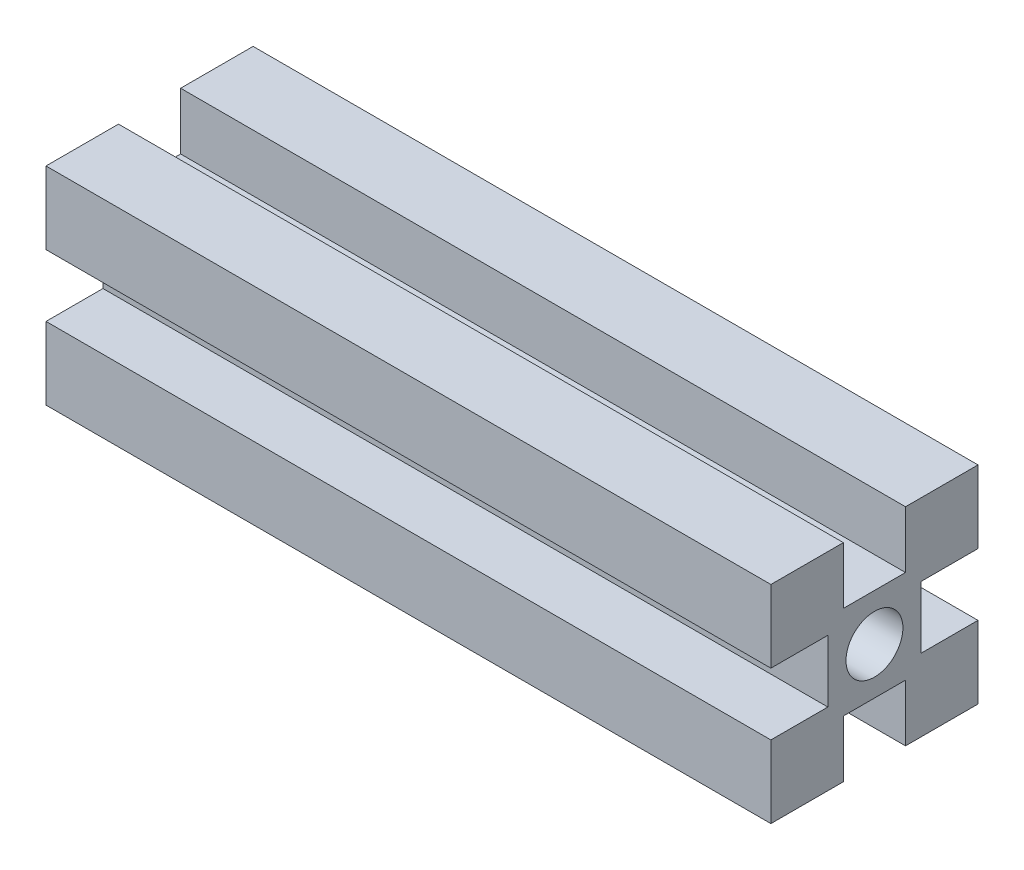
ISO-10303-21;
HEADER;
FILE_DESCRIPTION(('STEP AP214'),'2;1');
FILE_NAME('part.step','',(''),(''),'','','');
FILE_SCHEMA(('AUTOMOTIVE_DESIGN { 1 0 10303 214 1 1 1 1 }'));
ENDSEC;
DATA;
#1=APPLICATION_CONTEXT('core data for automotive mechanical design processes');
#2=APPLICATION_PROTOCOL_DEFINITION('international standard','automotive_design',2000,#1);
#3=PRODUCT_CONTEXT('',#1,'mechanical');
#4=PRODUCT('Part','Part','',(#3));
#5=PRODUCT_RELATED_PRODUCT_CATEGORY('part','',(#4));
#6=PRODUCT_DEFINITION_FORMATION('','',#4);
#7=PRODUCT_DEFINITION_CONTEXT('part definition',#1,'design');
#8=PRODUCT_DEFINITION('design','',#6,#7);
#9=PRODUCT_DEFINITION_SHAPE('','',#8);
#10=(LENGTH_UNIT() NAMED_UNIT(*) SI_UNIT(.MILLI.,.METRE.));
#11=(NAMED_UNIT(*) PLANE_ANGLE_UNIT() SI_UNIT($,.RADIAN.));
#12=(NAMED_UNIT(*) SI_UNIT($,.STERADIAN.) SOLID_ANGLE_UNIT());
#13=UNCERTAINTY_MEASURE_WITH_UNIT(LENGTH_MEASURE(1.E-05),#10,'distance_accuracy_value','');
#14=(GEOMETRIC_REPRESENTATION_CONTEXT(3) GLOBAL_UNCERTAINTY_ASSIGNED_CONTEXT((#13)) GLOBAL_UNIT_ASSIGNED_CONTEXT((#10,
#11,#12)) REPRESENTATION_CONTEXT('',''));
#15=CARTESIAN_POINT('',(0.,0.,0.));
#16=DIRECTION('',(0.,0.,1.));
#17=DIRECTION('',(1.,0.,0.));
#18=AXIS2_PLACEMENT_3D('',#15,#16,#17);
#19=CARTESIAN_POINT('',(70.,10.,-10.));
#20=DIRECTION('',(0.,0.,-1.));
#21=DIRECTION('',(-1.,0.,0.));
#22=AXIS2_PLACEMENT_3D('',#19,#20,#21);
#23=PLANE('',#22);
#24=DIRECTION('',(0.,-1.,0.));
#25=VECTOR('',#24,1.);
#26=CARTESIAN_POINT('',(0.,10.,-10.));
#27=LINE('',#26,#25);
#28=CARTESIAN_POINT('',(0.,10.,-10.));
#29=VERTEX_POINT('',#28);
#30=CARTESIAN_POINT('',(0.,3.,-10.));
#31=VERTEX_POINT('',#30);
#32=EDGE_CURVE('E214',#29,#31,#27,.T.);
#33=ORIENTED_EDGE('',*,*,#32,.F.);
#34=DIRECTION('',(-1.,0.,0.));
#35=VECTOR('',#34,1.);
#36=CARTESIAN_POINT('',(70.,10.,-10.));
#37=LINE('',#36,#35);
#38=CARTESIAN_POINT('',(70.,10.,-10.));
#39=VERTEX_POINT('',#38);
#40=EDGE_CURVE('E11',#39,#29,#37,.T.);
#41=ORIENTED_EDGE('',*,*,#40,.F.);
#42=DIRECTION('',(0.,-1.,0.));
#43=VECTOR('',#42,1.);
#44=CARTESIAN_POINT('',(70.,10.,-10.));
#45=LINE('',#44,#43);
#46=CARTESIAN_POINT('',(70.,3.,-10.));
#47=VERTEX_POINT('',#46);
#48=EDGE_CURVE('E291',#39,#47,#45,.T.);
#49=ORIENTED_EDGE('',*,*,#48,.T.);
#50=DIRECTION('',(-1.,0.,0.));
#51=VECTOR('',#50,1.);
#52=CARTESIAN_POINT('',(70.,3.,-10.));
#53=LINE('',#52,#51);
#54=EDGE_CURVE('E42',#47,#31,#53,.T.);
#55=ORIENTED_EDGE('',*,*,#54,.T.);
#56=EDGE_LOOP('',(#33,#41,#49,#55));
#57=FACE_BOUND('',#56,.T.);
#58=ADVANCED_FACE('F39',(#57),#23,.T.);
#59=CARTESIAN_POINT('',(70.,10.,-3.));
#60=DIRECTION('',(0.,1.,0.));
#61=DIRECTION('',(0.,0.,1.));
#62=AXIS2_PLACEMENT_3D('',#59,#60,#61);
#63=PLANE('',#62);
#64=DIRECTION('',(0.,0.,-1.));
#65=VECTOR('',#64,1.);
#66=CARTESIAN_POINT('',(0.,10.,-3.));
#67=LINE('',#66,#65);
#68=CARTESIAN_POINT('',(0.,10.,-3.));
#69=VERTEX_POINT('',#68);
#70=EDGE_CURVE('E288',#69,#29,#67,.T.);
#71=ORIENTED_EDGE('',*,*,#70,.F.);
#72=DIRECTION('',(-1.,0.,0.));
#73=VECTOR('',#72,1.);
#74=CARTESIAN_POINT('',(70.,10.,-3.));
#75=LINE('',#74,#73);
#76=CARTESIAN_POINT('',(70.,10.,-3.));
#77=VERTEX_POINT('',#76);
#78=EDGE_CURVE('E49',#77,#69,#75,.T.);
#79=ORIENTED_EDGE('',*,*,#78,.F.);
#80=DIRECTION('',(0.,0.,-1.));
#81=VECTOR('',#80,1.);
#82=CARTESIAN_POINT('',(70.,10.,-3.));
#83=LINE('',#82,#81);
#84=EDGE_CURVE('E200',#77,#39,#83,.T.);
#85=ORIENTED_EDGE('',*,*,#84,.T.);
#86=ORIENTED_EDGE('',*,*,#40,.T.);
#87=EDGE_LOOP('',(#71,#79,#85,#86));
#88=FACE_BOUND('',#87,.T.);
#89=ADVANCED_FACE('F345',(#88),#63,.T.);
#90=CARTESIAN_POINT('',(70.,4.5,-3.));
#91=DIRECTION('',(0.,0.,1.));
#92=DIRECTION('',(1.,0.,0.));
#93=AXIS2_PLACEMENT_3D('',#90,#91,#92);
#94=PLANE('',#93);
#95=DIRECTION('',(0.,1.,0.));
#96=VECTOR('',#95,1.);
#97=CARTESIAN_POINT('',(0.,4.5,-3.));
#98=LINE('',#97,#96);
#99=CARTESIAN_POINT('',(0.,4.5,-3.));
#100=VERTEX_POINT('',#99);
#101=EDGE_CURVE('E186',#100,#69,#98,.T.);
#102=ORIENTED_EDGE('',*,*,#101,.F.);
#103=DIRECTION('',(-1.,0.,0.));
#104=VECTOR('',#103,1.);
#105=CARTESIAN_POINT('',(70.,4.5,-3.));
#106=LINE('',#105,#104);
#107=CARTESIAN_POINT('',(70.,4.5,-3.));
#108=VERTEX_POINT('',#107);
#109=EDGE_CURVE('E181',#108,#100,#106,.T.);
#110=ORIENTED_EDGE('',*,*,#109,.F.);
#111=DIRECTION('',(0.,1.,0.));
#112=VECTOR('',#111,1.);
#113=CARTESIAN_POINT('',(70.,4.5,-3.));
#114=LINE('',#113,#112);
#115=EDGE_CURVE('E184',#108,#77,#114,.T.);
#116=ORIENTED_EDGE('',*,*,#115,.T.);
#117=ORIENTED_EDGE('',*,*,#78,.T.);
#118=EDGE_LOOP('',(#102,#110,#116,#117));
#119=FACE_BOUND('',#118,.T.);
#120=ADVANCED_FACE('F183',(#119),#94,.T.);
#121=CARTESIAN_POINT('',(70.,4.5,3.));
#122=DIRECTION('',(0.,1.,0.));
#123=DIRECTION('',(0.,0.,1.));
#124=AXIS2_PLACEMENT_3D('',#121,#122,#123);
#125=PLANE('',#124);
#126=DIRECTION('',(0.,0.,-1.));
#127=VECTOR('',#126,1.);
#128=CARTESIAN_POINT('',(0.,4.5,3.));
#129=LINE('',#128,#127);
#130=CARTESIAN_POINT('',(0.,4.5,3.));
#131=VERTEX_POINT('',#130);
#132=EDGE_CURVE('E283',#131,#100,#129,.T.);
#133=ORIENTED_EDGE('',*,*,#132,.F.);
#134=DIRECTION('',(-1.,0.,0.));
#135=VECTOR('',#134,1.);
#136=CARTESIAN_POINT('',(70.,4.5,3.));
#137=LINE('',#136,#135);
#138=CARTESIAN_POINT('',(70.,4.5,3.));
#139=VERTEX_POINT('',#138);
#140=EDGE_CURVE('E192',#139,#131,#137,.T.);
#141=ORIENTED_EDGE('',*,*,#140,.F.);
#142=DIRECTION('',(0.,0.,-1.));
#143=VECTOR('',#142,1.);
#144=CARTESIAN_POINT('',(70.,4.5,3.));
#145=LINE('',#144,#143);
#146=EDGE_CURVE('E198',#139,#108,#145,.T.);
#147=ORIENTED_EDGE('',*,*,#146,.T.);
#148=ORIENTED_EDGE('',*,*,#109,.T.);
#149=EDGE_LOOP('',(#133,#141,#147,#148));
#150=FACE_BOUND('',#149,.T.);
#151=ADVANCED_FACE('F203',(#150),#125,.T.);
#152=CARTESIAN_POINT('',(70.,10.,3.));
#153=DIRECTION('',(0.,0.,-1.));
#154=DIRECTION('',(-1.,0.,0.));
#155=AXIS2_PLACEMENT_3D('',#152,#153,#154);
#156=PLANE('',#155);
#157=DIRECTION('',(0.,-1.,0.));
#158=VECTOR('',#157,1.);
#159=CARTESIAN_POINT('',(0.,10.,3.));
#160=LINE('',#159,#158);
#161=CARTESIAN_POINT('',(0.,10.,3.));
#162=VERTEX_POINT('',#161);
#163=EDGE_CURVE('E279',#162,#131,#160,.T.);
#164=ORIENTED_EDGE('',*,*,#163,.F.);
#165=DIRECTION('',(-1.,0.,0.));
#166=VECTOR('',#165,1.);
#167=CARTESIAN_POINT('',(70.,10.,3.));
#168=LINE('',#167,#166);
#169=CARTESIAN_POINT('',(70.,10.,3.));
#170=VERTEX_POINT('',#169);
#171=EDGE_CURVE('E297',#170,#162,#168,.T.);
#172=ORIENTED_EDGE('',*,*,#171,.F.);
#173=DIRECTION('',(0.,-1.,0.));
#174=VECTOR('',#173,1.);
#175=CARTESIAN_POINT('',(70.,10.,3.));
#176=LINE('',#175,#174);
#177=EDGE_CURVE('E205',#170,#139,#176,.T.);
#178=ORIENTED_EDGE('',*,*,#177,.T.);
#179=ORIENTED_EDGE('',*,*,#140,.T.);
#180=EDGE_LOOP('',(#164,#172,#178,#179));
#181=FACE_BOUND('',#180,.T.);
#182=ADVANCED_FACE('F358',(#181),#156,.T.);
#183=CARTESIAN_POINT('',(70.,10.,10.));
#184=DIRECTION('',(0.,1.,0.));
#185=DIRECTION('',(0.,0.,1.));
#186=AXIS2_PLACEMENT_3D('',#183,#184,#185);
#187=PLANE('',#186);
#188=DIRECTION('',(0.,0.,-1.));
#189=VECTOR('',#188,1.);
#190=CARTESIAN_POINT('',(0.,10.,10.));
#191=LINE('',#190,#189);
#192=CARTESIAN_POINT('',(0.,10.,10.));
#193=VERTEX_POINT('',#192);
#194=EDGE_CURVE('E275',#193,#162,#191,.T.);
#195=ORIENTED_EDGE('',*,*,#194,.F.);
#196=DIRECTION('',(-1.,0.,0.));
#197=VECTOR('',#196,1.);
#198=CARTESIAN_POINT('',(70.,10.,10.));
#199=LINE('',#198,#197);
#200=CARTESIAN_POINT('',(70.,10.,10.));
#201=VERTEX_POINT('',#200);
#202=EDGE_CURVE('E300',#201,#193,#199,.T.);
#203=ORIENTED_EDGE('',*,*,#202,.F.);
#204=DIRECTION('',(0.,0.,-1.));
#205=VECTOR('',#204,1.);
#206=CARTESIAN_POINT('',(70.,10.,10.));
#207=LINE('',#206,#205);
#208=EDGE_CURVE('E208',#201,#170,#207,.T.);
#209=ORIENTED_EDGE('',*,*,#208,.T.);
#210=ORIENTED_EDGE('',*,*,#171,.T.);
#211=EDGE_LOOP('',(#195,#203,#209,#210));
#212=FACE_BOUND('',#211,.T.);
#213=ADVANCED_FACE('F361',(#212),#187,.T.);
#214=CARTESIAN_POINT('',(70.,3.,10.));
#215=DIRECTION('',(0.,0.,1.));
#216=DIRECTION('',(1.,0.,0.));
#217=AXIS2_PLACEMENT_3D('',#214,#215,#216);
#218=PLANE('',#217);
#219=DIRECTION('',(0.,1.,0.));
#220=VECTOR('',#219,1.);
#221=CARTESIAN_POINT('',(0.,3.,10.));
#222=LINE('',#221,#220);
#223=CARTESIAN_POINT('',(0.,3.,10.));
#224=VERTEX_POINT('',#223);
#225=EDGE_CURVE('E271',#224,#193,#222,.T.);
#226=ORIENTED_EDGE('',*,*,#225,.F.);
#227=DIRECTION('',(-1.,0.,0.));
#228=VECTOR('',#227,1.);
#229=CARTESIAN_POINT('',(70.,3.,10.));
#230=LINE('',#229,#228);
#231=CARTESIAN_POINT('',(70.,3.,10.));
#232=VERTEX_POINT('',#231);
#233=EDGE_CURVE('E303',#232,#224,#230,.T.);
#234=ORIENTED_EDGE('',*,*,#233,.F.);
#235=DIRECTION('',(0.,1.,0.));
#236=VECTOR('',#235,1.);
#237=CARTESIAN_POINT('',(70.,3.,10.));
#238=LINE('',#237,#236);
#239=EDGE_CURVE('E496',#232,#201,#238,.T.);
#240=ORIENTED_EDGE('',*,*,#239,.T.);
#241=ORIENTED_EDGE('',*,*,#202,.T.);
#242=EDGE_LOOP('',(#226,#234,#240,#241));
#243=FACE_BOUND('',#242,.T.);
#244=ADVANCED_FACE('F365',(#243),#218,.T.);
#245=CARTESIAN_POINT('',(70.,3.,4.5));
#246=DIRECTION('',(0.,-1.,0.));
#247=DIRECTION('',(0.,0.,-1.));
#248=AXIS2_PLACEMENT_3D('',#245,#246,#247);
#249=PLANE('',#248);
#250=DIRECTION('',(0.,0.,1.));
#251=VECTOR('',#250,1.);
#252=CARTESIAN_POINT('',(0.,3.,4.5));
#253=LINE('',#252,#251);
#254=CARTESIAN_POINT('',(0.,3.,4.5));
#255=VERTEX_POINT('',#254);
#256=EDGE_CURVE('E267',#255,#224,#253,.T.);
#257=ORIENTED_EDGE('',*,*,#256,.F.);
#258=DIRECTION('',(-1.,0.,0.));
#259=VECTOR('',#258,1.);
#260=CARTESIAN_POINT('',(70.,3.,4.5));
#261=LINE('',#260,#259);
#262=CARTESIAN_POINT('',(70.,3.,4.5));
#263=VERTEX_POINT('',#262);
#264=EDGE_CURVE('E306',#263,#255,#261,.T.);
#265=ORIENTED_EDGE('',*,*,#264,.F.);
#266=DIRECTION('',(0.,0.,1.));
#267=VECTOR('',#266,1.);
#268=CARTESIAN_POINT('',(70.,3.,4.5));
#269=LINE('',#268,#267);
#270=EDGE_CURVE('E492',#263,#232,#269,.T.);
#271=ORIENTED_EDGE('',*,*,#270,.T.);
#272=ORIENTED_EDGE('',*,*,#233,.T.);
#273=EDGE_LOOP('',(#257,#265,#271,#272));
#274=FACE_BOUND('',#273,.T.);
#275=ADVANCED_FACE('F369',(#274),#249,.T.);
#276=CARTESIAN_POINT('',(70.,-3.,4.5));
#277=DIRECTION('',(0.,0.,1.));
#278=DIRECTION('',(1.,0.,0.));
#279=AXIS2_PLACEMENT_3D('',#276,#277,#278);
#280=PLANE('',#279);
#281=DIRECTION('',(0.,1.,0.));
#282=VECTOR('',#281,1.);
#283=CARTESIAN_POINT('',(0.,-3.,4.5));
#284=LINE('',#283,#282);
#285=CARTESIAN_POINT('',(0.,-3.,4.5));
#286=VERTEX_POINT('',#285);
#287=EDGE_CURVE('E263',#286,#255,#284,.T.);
#288=ORIENTED_EDGE('',*,*,#287,.F.);
#289=DIRECTION('',(-1.,0.,0.));
#290=VECTOR('',#289,1.);
#291=CARTESIAN_POINT('',(70.,-3.,4.5));
#292=LINE('',#291,#290);
#293=CARTESIAN_POINT('',(70.,-3.,4.5));
#294=VERTEX_POINT('',#293);
#295=EDGE_CURVE('E309',#294,#286,#292,.T.);
#296=ORIENTED_EDGE('',*,*,#295,.F.);
#297=DIRECTION('',(0.,1.,0.));
#298=VECTOR('',#297,1.);
#299=CARTESIAN_POINT('',(70.,-3.,4.5));
#300=LINE('',#299,#298);
#301=EDGE_CURVE('E488',#294,#263,#300,.T.);
#302=ORIENTED_EDGE('',*,*,#301,.T.);
#303=ORIENTED_EDGE('',*,*,#264,.T.);
#304=EDGE_LOOP('',(#288,#296,#302,#303));
#305=FACE_BOUND('',#304,.T.);
#306=ADVANCED_FACE('F373',(#305),#280,.T.);
#307=CARTESIAN_POINT('',(70.,-3.,10.));
#308=DIRECTION('',(0.,1.,0.));
#309=DIRECTION('',(0.,0.,1.));
#310=AXIS2_PLACEMENT_3D('',#307,#308,#309);
#311=PLANE('',#310);
#312=DIRECTION('',(0.,0.,-1.));
#313=VECTOR('',#312,1.);
#314=CARTESIAN_POINT('',(0.,-3.,10.));
#315=LINE('',#314,#313);
#316=CARTESIAN_POINT('',(0.,-3.,10.));
#317=VERTEX_POINT('',#316);
#318=EDGE_CURVE('E259',#317,#286,#315,.T.);
#319=ORIENTED_EDGE('',*,*,#318,.F.);
#320=DIRECTION('',(-1.,0.,0.));
#321=VECTOR('',#320,1.);
#322=CARTESIAN_POINT('',(70.,-3.,10.));
#323=LINE('',#322,#321);
#324=CARTESIAN_POINT('',(70.,-3.,10.));
#325=VERTEX_POINT('',#324);
#326=EDGE_CURVE('E312',#325,#317,#323,.T.);
#327=ORIENTED_EDGE('',*,*,#326,.F.);
#328=DIRECTION('',(0.,0.,-1.));
#329=VECTOR('',#328,1.);
#330=CARTESIAN_POINT('',(70.,-3.,10.));
#331=LINE('',#330,#329);
#332=EDGE_CURVE('E484',#325,#294,#331,.T.);
#333=ORIENTED_EDGE('',*,*,#332,.T.);
#334=ORIENTED_EDGE('',*,*,#295,.T.);
#335=EDGE_LOOP('',(#319,#327,#333,#334));
#336=FACE_BOUND('',#335,.T.);
#337=ADVANCED_FACE('F377',(#336),#311,.T.);
#338=CARTESIAN_POINT('',(70.,-10.,10.));
#339=DIRECTION('',(0.,0.,1.));
#340=DIRECTION('',(1.,0.,0.));
#341=AXIS2_PLACEMENT_3D('',#338,#339,#340);
#342=PLANE('',#341);
#343=DIRECTION('',(0.,1.,0.));
#344=VECTOR('',#343,1.);
#345=CARTESIAN_POINT('',(0.,-10.,10.));
#346=LINE('',#345,#344);
#347=CARTESIAN_POINT('',(0.,-10.,10.));
#348=VERTEX_POINT('',#347);
#349=EDGE_CURVE('E255',#348,#317,#346,.T.);
#350=ORIENTED_EDGE('',*,*,#349,.F.);
#351=DIRECTION('',(-1.,0.,0.));
#352=VECTOR('',#351,1.);
#353=CARTESIAN_POINT('',(70.,-10.,10.));
#354=LINE('',#353,#352);
#355=CARTESIAN_POINT('',(70.,-10.,10.));
#356=VERTEX_POINT('',#355);
#357=EDGE_CURVE('E315',#356,#348,#354,.T.);
#358=ORIENTED_EDGE('',*,*,#357,.F.);
#359=DIRECTION('',(0.,1.,0.));
#360=VECTOR('',#359,1.);
#361=CARTESIAN_POINT('',(70.,-10.,10.));
#362=LINE('',#361,#360);
#363=EDGE_CURVE('E480',#356,#325,#362,.T.);
#364=ORIENTED_EDGE('',*,*,#363,.T.);
#365=ORIENTED_EDGE('',*,*,#326,.T.);
#366=EDGE_LOOP('',(#350,#358,#364,#365));
#367=FACE_BOUND('',#366,.T.);
#368=ADVANCED_FACE('F381',(#367),#342,.T.);
#369=CARTESIAN_POINT('',(70.,-10.,3.));
#370=DIRECTION('',(0.,-1.,0.));
#371=DIRECTION('',(0.,0.,-1.));
#372=AXIS2_PLACEMENT_3D('',#369,#370,#371);
#373=PLANE('',#372);
#374=DIRECTION('',(0.,0.,1.));
#375=VECTOR('',#374,1.);
#376=CARTESIAN_POINT('',(0.,-10.,3.));
#377=LINE('',#376,#375);
#378=CARTESIAN_POINT('',(0.,-10.,3.));
#379=VERTEX_POINT('',#378);
#380=EDGE_CURVE('E251',#379,#348,#377,.T.);
#381=ORIENTED_EDGE('',*,*,#380,.F.);
#382=DIRECTION('',(-1.,0.,0.));
#383=VECTOR('',#382,1.);
#384=CARTESIAN_POINT('',(70.,-10.,3.));
#385=LINE('',#384,#383);
#386=CARTESIAN_POINT('',(70.,-10.,3.));
#387=VERTEX_POINT('',#386);
#388=EDGE_CURVE('E318',#387,#379,#385,.T.);
#389=ORIENTED_EDGE('',*,*,#388,.F.);
#390=DIRECTION('',(0.,0.,1.));
#391=VECTOR('',#390,1.);
#392=CARTESIAN_POINT('',(70.,-10.,3.));
#393=LINE('',#392,#391);
#394=EDGE_CURVE('E476',#387,#356,#393,.T.);
#395=ORIENTED_EDGE('',*,*,#394,.T.);
#396=ORIENTED_EDGE('',*,*,#357,.T.);
#397=EDGE_LOOP('',(#381,#389,#395,#396));
#398=FACE_BOUND('',#397,.T.);
#399=ADVANCED_FACE('F385',(#398),#373,.T.);
#400=CARTESIAN_POINT('',(70.,-4.5,3.));
#401=DIRECTION('',(0.,0.,-1.));
#402=DIRECTION('',(-1.,0.,0.));
#403=AXIS2_PLACEMENT_3D('',#400,#401,#402);
#404=PLANE('',#403);
#405=DIRECTION('',(0.,-1.,0.));
#406=VECTOR('',#405,1.);
#407=CARTESIAN_POINT('',(0.,-4.5,3.));
#408=LINE('',#407,#406);
#409=CARTESIAN_POINT('',(0.,-4.5,3.));
#410=VERTEX_POINT('',#409);
#411=EDGE_CURVE('E247',#410,#379,#408,.T.);
#412=ORIENTED_EDGE('',*,*,#411,.F.);
#413=DIRECTION('',(-1.,0.,0.));
#414=VECTOR('',#413,1.);
#415=CARTESIAN_POINT('',(70.,-4.5,3.));
#416=LINE('',#415,#414);
#417=CARTESIAN_POINT('',(70.,-4.5,3.));
#418=VERTEX_POINT('',#417);
#419=EDGE_CURVE('E321',#418,#410,#416,.T.);
#420=ORIENTED_EDGE('',*,*,#419,.F.);
#421=DIRECTION('',(0.,-1.,0.));
#422=VECTOR('',#421,1.);
#423=CARTESIAN_POINT('',(70.,-4.5,3.));
#424=LINE('',#423,#422);
#425=EDGE_CURVE('E472',#418,#387,#424,.T.);
#426=ORIENTED_EDGE('',*,*,#425,.T.);
#427=ORIENTED_EDGE('',*,*,#388,.T.);
#428=EDGE_LOOP('',(#412,#420,#426,#427));
#429=FACE_BOUND('',#428,.T.);
#430=ADVANCED_FACE('F389',(#429),#404,.T.);
#431=CARTESIAN_POINT('',(70.,-4.5,-3.));
#432=DIRECTION('',(0.,-1.,0.));
#433=DIRECTION('',(0.,0.,-1.));
#434=AXIS2_PLACEMENT_3D('',#431,#432,#433);
#435=PLANE('',#434);
#436=DIRECTION('',(0.,0.,1.));
#437=VECTOR('',#436,1.);
#438=CARTESIAN_POINT('',(0.,-4.5,-3.));
#439=LINE('',#438,#437);
#440=CARTESIAN_POINT('',(0.,-4.5,-3.));
#441=VERTEX_POINT('',#440);
#442=EDGE_CURVE('E243',#441,#410,#439,.T.);
#443=ORIENTED_EDGE('',*,*,#442,.F.);
#444=DIRECTION('',(-1.,0.,0.));
#445=VECTOR('',#444,1.);
#446=CARTESIAN_POINT('',(70.,-4.5,-3.));
#447=LINE('',#446,#445);
#448=CARTESIAN_POINT('',(70.,-4.5,-3.));
#449=VERTEX_POINT('',#448);
#450=EDGE_CURVE('E324',#449,#441,#447,.T.);
#451=ORIENTED_EDGE('',*,*,#450,.F.);
#452=DIRECTION('',(0.,0.,1.));
#453=VECTOR('',#452,1.);
#454=CARTESIAN_POINT('',(70.,-4.5,-3.));
#455=LINE('',#454,#453);
#456=EDGE_CURVE('E468',#449,#418,#455,.T.);
#457=ORIENTED_EDGE('',*,*,#456,.T.);
#458=ORIENTED_EDGE('',*,*,#419,.T.);
#459=EDGE_LOOP('',(#443,#451,#457,#458));
#460=FACE_BOUND('',#459,.T.);
#461=ADVANCED_FACE('F393',(#460),#435,.T.);
#462=CARTESIAN_POINT('',(70.,-10.,-3.));
#463=DIRECTION('',(0.,0.,1.));
#464=DIRECTION('',(1.,0.,0.));
#465=AXIS2_PLACEMENT_3D('',#462,#463,#464);
#466=PLANE('',#465);
#467=DIRECTION('',(0.,1.,0.));
#468=VECTOR('',#467,1.);
#469=CARTESIAN_POINT('',(0.,-10.,-3.));
#470=LINE('',#469,#468);
#471=CARTESIAN_POINT('',(0.,-10.,-3.));
#472=VERTEX_POINT('',#471);
#473=EDGE_CURVE('E239',#472,#441,#470,.T.);
#474=ORIENTED_EDGE('',*,*,#473,.F.);
#475=DIRECTION('',(-1.,0.,0.));
#476=VECTOR('',#475,1.);
#477=CARTESIAN_POINT('',(70.,-10.,-3.));
#478=LINE('',#477,#476);
#479=CARTESIAN_POINT('',(70.,-10.,-3.));
#480=VERTEX_POINT('',#479);
#481=EDGE_CURVE('E327',#480,#472,#478,.T.);
#482=ORIENTED_EDGE('',*,*,#481,.F.);
#483=DIRECTION('',(0.,1.,0.));
#484=VECTOR('',#483,1.);
#485=CARTESIAN_POINT('',(70.,-10.,-3.));
#486=LINE('',#485,#484);
#487=EDGE_CURVE('E464',#480,#449,#486,.T.);
#488=ORIENTED_EDGE('',*,*,#487,.T.);
#489=ORIENTED_EDGE('',*,*,#450,.T.);
#490=EDGE_LOOP('',(#474,#482,#488,#489));
#491=FACE_BOUND('',#490,.T.);
#492=ADVANCED_FACE('F397',(#491),#466,.T.);
#493=CARTESIAN_POINT('',(70.,-10.,-10.));
#494=DIRECTION('',(0.,-1.,0.));
#495=DIRECTION('',(0.,0.,-1.));
#496=AXIS2_PLACEMENT_3D('',#493,#494,#495);
#497=PLANE('',#496);
#498=DIRECTION('',(0.,0.,1.));
#499=VECTOR('',#498,1.);
#500=CARTESIAN_POINT('',(0.,-10.,-10.));
#501=LINE('',#500,#499);
#502=CARTESIAN_POINT('',(0.,-10.,-10.));
#503=VERTEX_POINT('',#502);
#504=EDGE_CURVE('E235',#503,#472,#501,.T.);
#505=ORIENTED_EDGE('',*,*,#504,.F.);
#506=DIRECTION('',(-1.,0.,0.));
#507=VECTOR('',#506,1.);
#508=CARTESIAN_POINT('',(70.,-10.,-10.));
#509=LINE('',#508,#507);
#510=CARTESIAN_POINT('',(70.,-10.,-10.));
#511=VERTEX_POINT('',#510);
#512=EDGE_CURVE('E330',#511,#503,#509,.T.);
#513=ORIENTED_EDGE('',*,*,#512,.F.);
#514=DIRECTION('',(0.,0.,1.));
#515=VECTOR('',#514,1.);
#516=CARTESIAN_POINT('',(70.,-10.,-10.));
#517=LINE('',#516,#515);
#518=EDGE_CURVE('E460',#511,#480,#517,.T.);
#519=ORIENTED_EDGE('',*,*,#518,.T.);
#520=ORIENTED_EDGE('',*,*,#481,.T.);
#521=EDGE_LOOP('',(#505,#513,#519,#520));
#522=FACE_BOUND('',#521,.T.);
#523=ADVANCED_FACE('F401',(#522),#497,.T.);
#524=CARTESIAN_POINT('',(70.,-3.,-10.));
#525=DIRECTION('',(0.,0.,-1.));
#526=DIRECTION('',(-1.,0.,0.));
#527=AXIS2_PLACEMENT_3D('',#524,#525,#526);
#528=PLANE('',#527);
#529=DIRECTION('',(0.,-1.,0.));
#530=VECTOR('',#529,1.);
#531=CARTESIAN_POINT('',(0.,-3.,-10.));
#532=LINE('',#531,#530);
#533=CARTESIAN_POINT('',(0.,-3.,-10.));
#534=VERTEX_POINT('',#533);
#535=EDGE_CURVE('E231',#534,#503,#532,.T.);
#536=ORIENTED_EDGE('',*,*,#535,.F.);
#537=DIRECTION('',(-1.,0.,0.));
#538=VECTOR('',#537,1.);
#539=CARTESIAN_POINT('',(70.,-3.,-10.));
#540=LINE('',#539,#538);
#541=CARTESIAN_POINT('',(70.,-3.,-10.));
#542=VERTEX_POINT('',#541);
#543=EDGE_CURVE('E333',#542,#534,#540,.T.);
#544=ORIENTED_EDGE('',*,*,#543,.F.);
#545=DIRECTION('',(0.,-1.,0.));
#546=VECTOR('',#545,1.);
#547=CARTESIAN_POINT('',(70.,-3.,-10.));
#548=LINE('',#547,#546);
#549=EDGE_CURVE('E456',#542,#511,#548,.T.);
#550=ORIENTED_EDGE('',*,*,#549,.T.);
#551=ORIENTED_EDGE('',*,*,#512,.T.);
#552=EDGE_LOOP('',(#536,#544,#550,#551));
#553=FACE_BOUND('',#552,.T.);
#554=ADVANCED_FACE('F405',(#553),#528,.T.);
#555=CARTESIAN_POINT('',(70.,-3.,-4.5));
#556=DIRECTION('',(0.,1.,0.));
#557=DIRECTION('',(0.,0.,1.));
#558=AXIS2_PLACEMENT_3D('',#555,#556,#557);
#559=PLANE('',#558);
#560=DIRECTION('',(0.,0.,-1.));
#561=VECTOR('',#560,1.);
#562=CARTESIAN_POINT('',(0.,-3.,-4.5));
#563=LINE('',#562,#561);
#564=CARTESIAN_POINT('',(0.,-3.,-4.5));
#565=VERTEX_POINT('',#564);
#566=EDGE_CURVE('E227',#565,#534,#563,.T.);
#567=ORIENTED_EDGE('',*,*,#566,.F.);
#568=DIRECTION('',(-1.,0.,0.));
#569=VECTOR('',#568,1.);
#570=CARTESIAN_POINT('',(70.,-3.,-4.5));
#571=LINE('',#570,#569);
#572=CARTESIAN_POINT('',(70.,-3.,-4.5));
#573=VERTEX_POINT('',#572);
#574=EDGE_CURVE('E336',#573,#565,#571,.T.);
#575=ORIENTED_EDGE('',*,*,#574,.F.);
#576=DIRECTION('',(0.,0.,-1.));
#577=VECTOR('',#576,1.);
#578=CARTESIAN_POINT('',(70.,-3.,-4.5));
#579=LINE('',#578,#577);
#580=EDGE_CURVE('E452',#573,#542,#579,.T.);
#581=ORIENTED_EDGE('',*,*,#580,.T.);
#582=ORIENTED_EDGE('',*,*,#543,.T.);
#583=EDGE_LOOP('',(#567,#575,#581,#582));
#584=FACE_BOUND('',#583,.T.);
#585=ADVANCED_FACE('F409',(#584),#559,.T.);
#586=CARTESIAN_POINT('',(70.,3.,-4.5));
#587=DIRECTION('',(0.,0.,-1.));
#588=DIRECTION('',(-1.,0.,0.));
#589=AXIS2_PLACEMENT_3D('',#586,#587,#588);
#590=PLANE('',#589);
#591=DIRECTION('',(0.,-1.,0.));
#592=VECTOR('',#591,1.);
#593=CARTESIAN_POINT('',(0.,3.,-4.5));
#594=LINE('',#593,#592);
#595=CARTESIAN_POINT('',(0.,3.,-4.5));
#596=VERTEX_POINT('',#595);
#597=EDGE_CURVE('E223',#596,#565,#594,.T.);
#598=ORIENTED_EDGE('',*,*,#597,.F.);
#599=DIRECTION('',(-1.,0.,0.));
#600=VECTOR('',#599,1.);
#601=CARTESIAN_POINT('',(70.,3.,-4.5));
#602=LINE('',#601,#600);
#603=CARTESIAN_POINT('',(70.,3.,-4.5));
#604=VERTEX_POINT('',#603);
#605=EDGE_CURVE('E338',#604,#596,#602,.T.);
#606=ORIENTED_EDGE('',*,*,#605,.F.);
#607=DIRECTION('',(0.,-1.,0.));
#608=VECTOR('',#607,1.);
#609=CARTESIAN_POINT('',(70.,3.,-4.5));
#610=LINE('',#609,#608);
#611=EDGE_CURVE('E448',#604,#573,#610,.T.);
#612=ORIENTED_EDGE('',*,*,#611,.T.);
#613=ORIENTED_EDGE('',*,*,#574,.T.);
#614=EDGE_LOOP('',(#598,#606,#612,#613));
#615=FACE_BOUND('',#614,.T.);
#616=ADVANCED_FACE('F413',(#615),#590,.T.);
#617=CARTESIAN_POINT('',(70.,3.,-10.));
#618=DIRECTION('',(0.,-1.,0.));
#619=DIRECTION('',(0.,0.,-1.));
#620=AXIS2_PLACEMENT_3D('',#617,#618,#619);
#621=PLANE('',#620);
#622=DIRECTION('',(0.,0.,1.));
#623=VECTOR('',#622,1.);
#624=CARTESIAN_POINT('',(0.,3.,-10.));
#625=LINE('',#624,#623);
#626=EDGE_CURVE('E218',#31,#596,#625,.T.);
#627=ORIENTED_EDGE('',*,*,#626,.F.);
#628=ORIENTED_EDGE('',*,*,#54,.F.);
#629=DIRECTION('',(0.,0.,1.));
#630=VECTOR('',#629,1.);
#631=CARTESIAN_POINT('',(70.,3.,-10.));
#632=LINE('',#631,#630);
#633=EDGE_CURVE('E445',#47,#604,#632,.T.);
#634=ORIENTED_EDGE('',*,*,#633,.T.);
#635=ORIENTED_EDGE('',*,*,#605,.T.);
#636=EDGE_LOOP('',(#627,#628,#634,#635));
#637=FACE_BOUND('',#636,.T.);
#638=ADVANCED_FACE('F342',(#637),#621,.T.);
#639=CARTESIAN_POINT('',(70.,0.,0.));
#640=DIRECTION('',(-1.,0.,0.));
#641=DIRECTION('',(0.,0.,1.));
#642=AXIS2_PLACEMENT_3D('',#639,#640,#641);
#643=PLANE('',#642);
#644=CARTESIAN_POINT('',(70.,0.,0.));
#645=DIRECTION('',(-1.,0.,0.));
#646=DIRECTION('',(0.,0.,-1.));
#647=AXIS2_PLACEMENT_3D('',#644,#645,#646);
#648=CIRCLE('',#647,2.75);
#649=CARTESIAN_POINT('',(70.,0.,-2.75));
#650=VERTEX_POINT('',#649);
#651=EDGE_CURVE('E219',#650,#650,#648,.T.);
#652=ORIENTED_EDGE('',*,*,#651,.T.);
#653=EDGE_LOOP('',(#652));
#654=FACE_BOUND('',#653,.T.);
#655=ORIENTED_EDGE('',*,*,#48,.F.);
#656=ORIENTED_EDGE('',*,*,#84,.F.);
#657=ORIENTED_EDGE('',*,*,#115,.F.);
#658=ORIENTED_EDGE('',*,*,#146,.F.);
#659=ORIENTED_EDGE('',*,*,#177,.F.);
#660=ORIENTED_EDGE('',*,*,#208,.F.);
#661=ORIENTED_EDGE('',*,*,#239,.F.);
#662=ORIENTED_EDGE('',*,*,#270,.F.);
#663=ORIENTED_EDGE('',*,*,#301,.F.);
#664=ORIENTED_EDGE('',*,*,#332,.F.);
#665=ORIENTED_EDGE('',*,*,#363,.F.);
#666=ORIENTED_EDGE('',*,*,#394,.F.);
#667=ORIENTED_EDGE('',*,*,#425,.F.);
#668=ORIENTED_EDGE('',*,*,#456,.F.);
#669=ORIENTED_EDGE('',*,*,#487,.F.);
#670=ORIENTED_EDGE('',*,*,#518,.F.);
#671=ORIENTED_EDGE('',*,*,#549,.F.);
#672=ORIENTED_EDGE('',*,*,#580,.F.);
#673=ORIENTED_EDGE('',*,*,#611,.F.);
#674=ORIENTED_EDGE('',*,*,#633,.F.);
#675=EDGE_LOOP('',(#655,#656,#657,#658,#659,#660,#661,#662,#663,#664,#665,#666,#667,#668,#669,
#670,#671,#672,#673,#674));
#676=FACE_BOUND('',#675,.T.);
#677=ADVANCED_FACE('F196',(#654,#676),#643,.F.);
#678=CARTESIAN_POINT('',(0.,0.,0.));
#679=DIRECTION('',(-1.,0.,0.));
#680=DIRECTION('',(0.,0.,1.));
#681=AXIS2_PLACEMENT_3D('',#678,#679,#680);
#682=PLANE('',#681);
#683=CARTESIAN_POINT('',(0.,0.,0.));
#684=DIRECTION('',(-1.,0.,0.));
#685=DIRECTION('',(0.,0.,-1.));
#686=AXIS2_PLACEMENT_3D('',#683,#684,#685);
#687=CIRCLE('',#686,2.75);
#688=CARTESIAN_POINT('',(0.,0.,-2.75));
#689=VERTEX_POINT('',#688);
#690=EDGE_CURVE('E437',#689,#689,#687,.T.);
#691=ORIENTED_EDGE('',*,*,#690,.F.);
#692=EDGE_LOOP('',(#691));
#693=FACE_BOUND('',#692,.T.);
#694=ORIENTED_EDGE('',*,*,#32,.T.);
#695=ORIENTED_EDGE('',*,*,#626,.T.);
#696=ORIENTED_EDGE('',*,*,#597,.T.);
#697=ORIENTED_EDGE('',*,*,#566,.T.);
#698=ORIENTED_EDGE('',*,*,#535,.T.);
#699=ORIENTED_EDGE('',*,*,#504,.T.);
#700=ORIENTED_EDGE('',*,*,#473,.T.);
#701=ORIENTED_EDGE('',*,*,#442,.T.);
#702=ORIENTED_EDGE('',*,*,#411,.T.);
#703=ORIENTED_EDGE('',*,*,#380,.T.);
#704=ORIENTED_EDGE('',*,*,#349,.T.);
#705=ORIENTED_EDGE('',*,*,#318,.T.);
#706=ORIENTED_EDGE('',*,*,#287,.T.);
#707=ORIENTED_EDGE('',*,*,#256,.T.);
#708=ORIENTED_EDGE('',*,*,#225,.T.);
#709=ORIENTED_EDGE('',*,*,#194,.T.);
#710=ORIENTED_EDGE('',*,*,#163,.T.);
#711=ORIENTED_EDGE('',*,*,#132,.T.);
#712=ORIENTED_EDGE('',*,*,#101,.T.);
#713=ORIENTED_EDGE('',*,*,#70,.T.);
#714=EDGE_LOOP('',(#694,#695,#696,#697,#698,#699,#700,#701,#702,#703,#704,#705,#706,#707,#708,
#709,#710,#711,#712,#713));
#715=FACE_BOUND('',#714,.T.);
#716=ADVANCED_FACE('F344',(#693,#715),#682,.T.);
#717=CARTESIAN_POINT('',(70.,0.,0.));
#718=DIRECTION('',(-1.,0.,0.));
#719=DIRECTION('',(0.,0.,1.));
#720=AXIS2_PLACEMENT_3D('',#717,#718,#719);
#721=CYLINDRICAL_SURFACE('',#720,2.75);
#722=ORIENTED_EDGE('',*,*,#651,.F.);
#723=EDGE_LOOP('',(#722));
#724=FACE_BOUND('',#723,.T.);
#725=ORIENTED_EDGE('',*,*,#690,.T.);
#726=EDGE_LOOP('',(#725));
#727=FACE_BOUND('',#726,.T.);
#728=ADVANCED_FACE('F425',(#724,#727),#721,.F.);
#729=CLOSED_SHELL('',(#58,#89,#120,#151,#182,#213,#244,#275,#306,#337,#368,#399,#430,#461,#492,
#523,#554,#585,#616,#638,#677,#716,#728));
#730=MANIFOLD_SOLID_BREP('B2',#729);
#731=ADVANCED_BREP_SHAPE_REPRESENTATION('',(#18,#730),#14);
#732=SHAPE_DEFINITION_REPRESENTATION(#9,#731);
ENDSEC;
END-ISO-10303-21;
